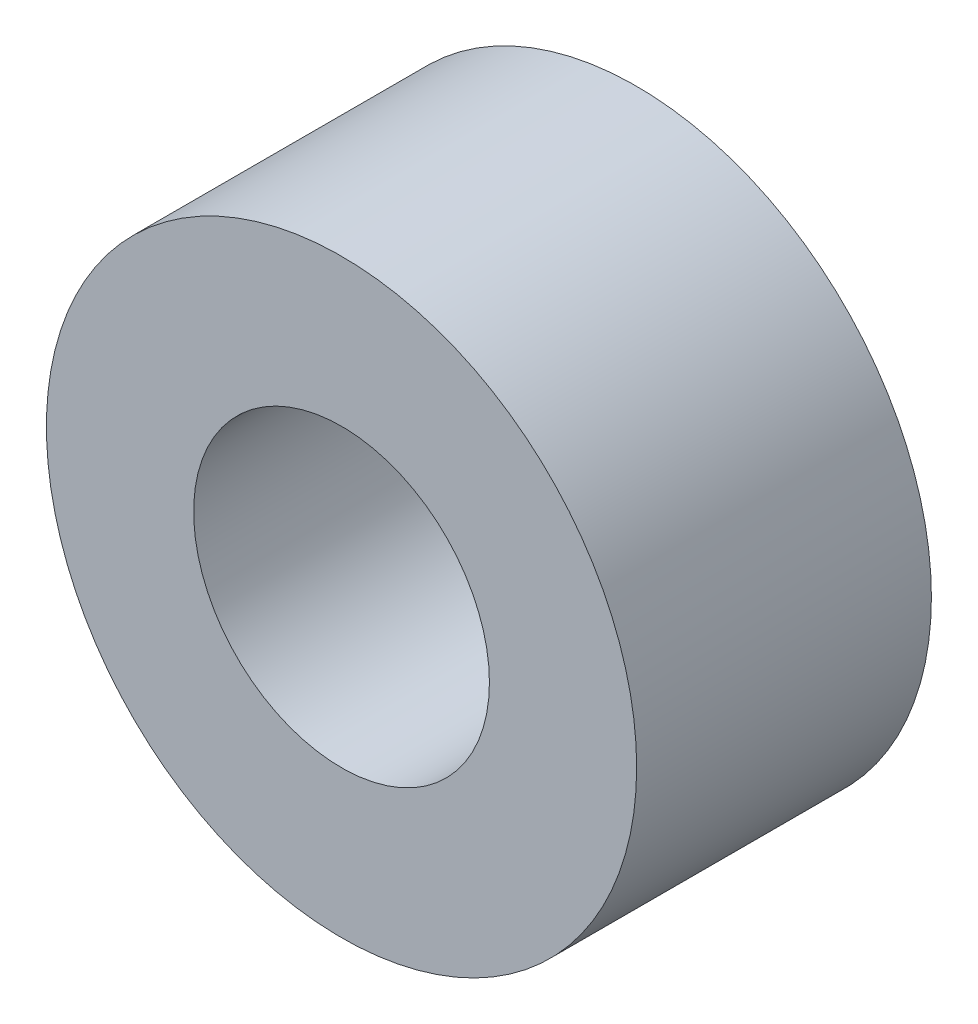
ISO-10303-21;
HEADER;
FILE_DESCRIPTION(('STEP AP214'),'2;1');
FILE_NAME('part.step','',(''),(''),'','','');
FILE_SCHEMA(('AUTOMOTIVE_DESIGN { 1 0 10303 214 1 1 1 1 }'));
ENDSEC;
DATA;
#1=APPLICATION_CONTEXT('core data for automotive mechanical design processes');
#2=APPLICATION_PROTOCOL_DEFINITION('international standard','automotive_design',2000,#1);
#3=PRODUCT_CONTEXT('',#1,'mechanical');
#4=PRODUCT('Part','Part','',(#3));
#5=PRODUCT_RELATED_PRODUCT_CATEGORY('part','',(#4));
#6=PRODUCT_DEFINITION_FORMATION('','',#4);
#7=PRODUCT_DEFINITION_CONTEXT('part definition',#1,'design');
#8=PRODUCT_DEFINITION('design','',#6,#7);
#9=PRODUCT_DEFINITION_SHAPE('','',#8);
#10=(LENGTH_UNIT() NAMED_UNIT(*) SI_UNIT(.MILLI.,.METRE.));
#11=(NAMED_UNIT(*) PLANE_ANGLE_UNIT() SI_UNIT($,.RADIAN.));
#12=(NAMED_UNIT(*) SI_UNIT($,.STERADIAN.) SOLID_ANGLE_UNIT());
#13=UNCERTAINTY_MEASURE_WITH_UNIT(LENGTH_MEASURE(1.E-05),#10,'distance_accuracy_value','');
#14=(GEOMETRIC_REPRESENTATION_CONTEXT(3) GLOBAL_UNCERTAINTY_ASSIGNED_CONTEXT((#13)) GLOBAL_UNIT_ASSIGNED_CONTEXT((#10,
#11,#12)) REPRESENTATION_CONTEXT('',''));
#15=CARTESIAN_POINT('',(0.,0.,0.));
#16=DIRECTION('',(0.,0.,1.));
#17=DIRECTION('',(1.,0.,0.));
#18=AXIS2_PLACEMENT_3D('',#15,#16,#17);
#19=CARTESIAN_POINT('',(0.,0.,60.));
#20=DIRECTION('',(0.,0.,-1.));
#21=DIRECTION('',(-1.,0.,0.));
#22=AXIS2_PLACEMENT_3D('',#19,#20,#21);
#23=CYLINDRICAL_SURFACE('',#22,60.0780401416765);
#24=CARTESIAN_POINT('',(0.,0.,60.));
#25=DIRECTION('',(0.,0.,1.));
#26=DIRECTION('',(1.,0.,0.));
#27=AXIS2_PLACEMENT_3D('',#24,#25,#26);
#28=CIRCLE('',#27,60.0780401416765);
#29=CARTESIAN_POINT('',(60.0780401416765,0.,60.));
#30=VERTEX_POINT('',#29);
#31=EDGE_CURVE('E10',#30,#30,#28,.T.);
#32=ORIENTED_EDGE('',*,*,#31,.F.);
#33=EDGE_LOOP('',(#32));
#34=FACE_BOUND('',#33,.T.);
#35=CARTESIAN_POINT('',(0.,0.,0.));
#36=DIRECTION('',(0.,0.,1.));
#37=DIRECTION('',(1.,0.,0.));
#38=AXIS2_PLACEMENT_3D('',#35,#36,#37);
#39=CIRCLE('',#38,60.0780401416765);
#40=CARTESIAN_POINT('',(60.0780401416765,0.,0.));
#41=VERTEX_POINT('',#40);
#42=EDGE_CURVE('E32',#41,#41,#39,.T.);
#43=ORIENTED_EDGE('',*,*,#42,.T.);
#44=EDGE_LOOP('',(#43));
#45=FACE_BOUND('',#44,.T.);
#46=ADVANCED_FACE('F29',(#34,#45),#23,.T.);
#47=CARTESIAN_POINT('',(0.,0.,60.));
#48=DIRECTION('',(0.,0.,1.));
#49=DIRECTION('',(1.,0.,0.));
#50=AXIS2_PLACEMENT_3D('',#47,#48,#49);
#51=PLANE('',#50);
#52=CARTESIAN_POINT('',(0.,0.,60.));
#53=DIRECTION('',(0.,0.,1.));
#54=DIRECTION('',(1.,0.,0.));
#55=AXIS2_PLACEMENT_3D('',#52,#53,#54);
#56=CIRCLE('',#55,30.1060098834061);
#57=CARTESIAN_POINT('',(30.1060098834061,0.,60.));
#58=VERTEX_POINT('',#57);
#59=EDGE_CURVE('E41',#58,#58,#56,.T.);
#60=ORIENTED_EDGE('',*,*,#59,.F.);
#61=EDGE_LOOP('',(#60));
#62=FACE_BOUND('',#61,.T.);
#63=ORIENTED_EDGE('',*,*,#31,.T.);
#64=EDGE_LOOP('',(#63));
#65=FACE_BOUND('',#64,.T.);
#66=ADVANCED_FACE('F56',(#62,#65),#51,.T.);
#67=CARTESIAN_POINT('',(0.,0.,0.));
#68=DIRECTION('',(0.,0.,1.));
#69=DIRECTION('',(1.,0.,0.));
#70=AXIS2_PLACEMENT_3D('',#67,#68,#69);
#71=PLANE('',#70);
#72=CARTESIAN_POINT('',(0.,0.,0.));
#73=DIRECTION('',(0.,0.,1.));
#74=DIRECTION('',(1.,0.,0.));
#75=AXIS2_PLACEMENT_3D('',#72,#73,#74);
#76=CIRCLE('',#75,30.1060098834061);
#77=CARTESIAN_POINT('',(30.1060098834061,0.,0.));
#78=VERTEX_POINT('',#77);
#79=EDGE_CURVE('E39',#78,#78,#76,.T.);
#80=ORIENTED_EDGE('',*,*,#79,.T.);
#81=EDGE_LOOP('',(#80));
#82=FACE_BOUND('',#81,.T.);
#83=ORIENTED_EDGE('',*,*,#42,.F.);
#84=EDGE_LOOP('',(#83));
#85=FACE_BOUND('',#84,.T.);
#86=ADVANCED_FACE('F47',(#82,#85),#71,.F.);
#87=CARTESIAN_POINT('',(0.,0.,0.));
#88=DIRECTION('',(0.,0.,1.));
#89=DIRECTION('',(1.,0.,0.));
#90=AXIS2_PLACEMENT_3D('',#87,#88,#89);
#91=CYLINDRICAL_SURFACE('',#90,30.1060098834061);
#92=ORIENTED_EDGE('',*,*,#79,.F.);
#93=EDGE_LOOP('',(#92));
#94=FACE_BOUND('',#93,.T.);
#95=ORIENTED_EDGE('',*,*,#59,.T.);
#96=EDGE_LOOP('',(#95));
#97=FACE_BOUND('',#96,.T.);
#98=ADVANCED_FACE('F50',(#94,#97),#91,.F.);
#99=CLOSED_SHELL('',(#46,#66,#86,#98));
#100=MANIFOLD_SOLID_BREP('B2',#99);
#101=ADVANCED_BREP_SHAPE_REPRESENTATION('',(#18,#100),#14);
#102=SHAPE_DEFINITION_REPRESENTATION(#9,#101);
ENDSEC;
END-ISO-10303-21;
